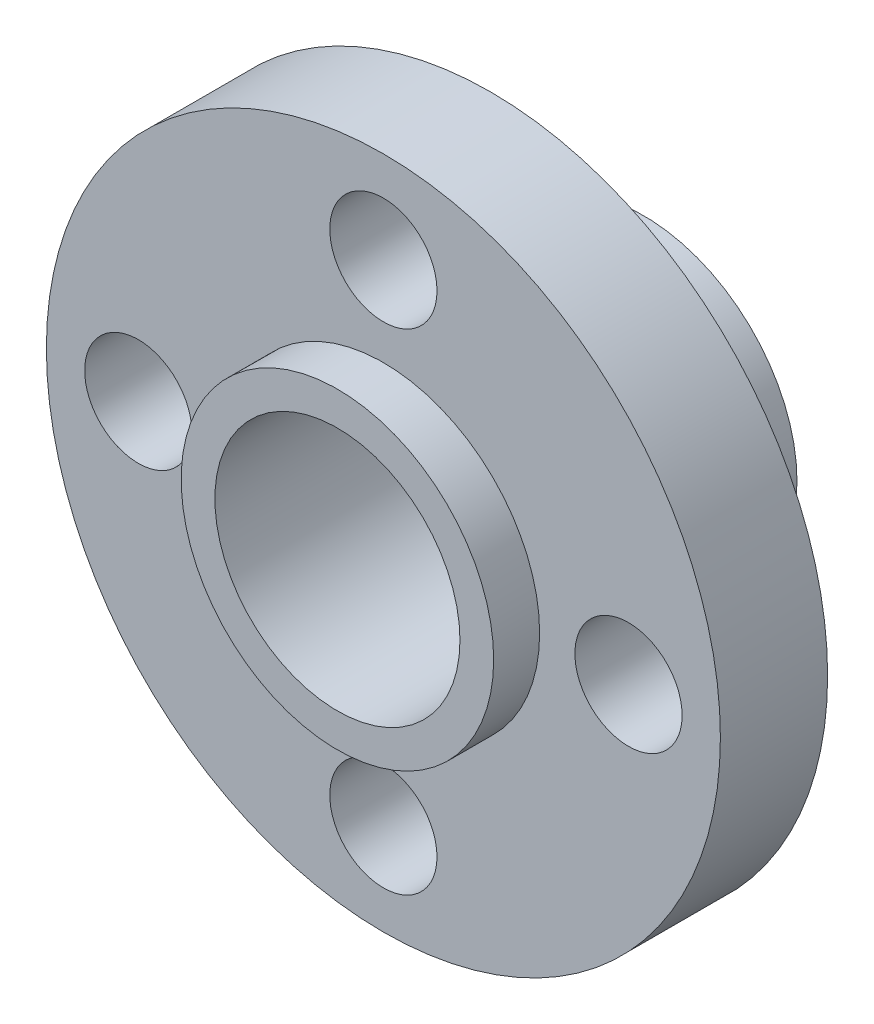
ISO-10303-21;
HEADER;
FILE_DESCRIPTION(('STEP AP214'),'2;1');
FILE_NAME('part.step','',(''),(''),'','','');
FILE_SCHEMA(('AUTOMOTIVE_DESIGN { 1 0 10303 214 1 1 1 1 }'));
ENDSEC;
DATA;
#1=APPLICATION_CONTEXT('core data for automotive mechanical design processes');
#2=APPLICATION_PROTOCOL_DEFINITION('international standard','automotive_design',2000,#1);
#3=PRODUCT_CONTEXT('',#1,'mechanical');
#4=PRODUCT('Part','Part','',(#3));
#5=PRODUCT_RELATED_PRODUCT_CATEGORY('part','',(#4));
#6=PRODUCT_DEFINITION_FORMATION('','',#4);
#7=PRODUCT_DEFINITION_CONTEXT('part definition',#1,'design');
#8=PRODUCT_DEFINITION('design','',#6,#7);
#9=PRODUCT_DEFINITION_SHAPE('','',#8);
#10=(LENGTH_UNIT() NAMED_UNIT(*) SI_UNIT(.MILLI.,.METRE.));
#11=(NAMED_UNIT(*) PLANE_ANGLE_UNIT() SI_UNIT($,.RADIAN.));
#12=(NAMED_UNIT(*) SI_UNIT($,.STERADIAN.) SOLID_ANGLE_UNIT());
#13=UNCERTAINTY_MEASURE_WITH_UNIT(LENGTH_MEASURE(1.E-05),#10,'distance_accuracy_value','');
#14=(GEOMETRIC_REPRESENTATION_CONTEXT(3) GLOBAL_UNCERTAINTY_ASSIGNED_CONTEXT((#13)) GLOBAL_UNIT_ASSIGNED_CONTEXT((#10,
#11,#12)) REPRESENTATION_CONTEXT('',''));
#15=CARTESIAN_POINT('',(0.,0.,0.));
#16=DIRECTION('',(0.,0.,1.));
#17=DIRECTION('',(1.,0.,0.));
#18=AXIS2_PLACEMENT_3D('',#15,#16,#17);
#19=CARTESIAN_POINT('',(0.,0.,3.5));
#20=DIRECTION('',(0.,0.,1.));
#21=DIRECTION('',(1.,0.,0.));
#22=AXIS2_PLACEMENT_3D('',#19,#20,#21);
#23=PLANE('',#22);
#24=CARTESIAN_POINT('',(0.,0.,3.5));
#25=DIRECTION('',(0.,0.,1.));
#26=DIRECTION('',(1.,0.,0.));
#27=AXIS2_PLACEMENT_3D('',#24,#25,#26);
#28=CIRCLE('',#27,5.1);
#29=CARTESIAN_POINT('',(5.1,0.,3.5));
#30=VERTEX_POINT('',#29);
#31=EDGE_CURVE('E73',#30,#30,#28,.T.);
#32=ORIENTED_EDGE('',*,*,#31,.F.);
#33=EDGE_LOOP('',(#32));
#34=FACE_BOUND('',#33,.T.);
#35=CARTESIAN_POINT('',(4.53155310047573E-13,-8.,3.5));
#36=DIRECTION('',(0.,0.,1.));
#37=DIRECTION('',(1.,0.,0.));
#38=AXIS2_PLACEMENT_3D('',#35,#36,#37);
#39=CIRCLE('',#38,1.75000000000049);
#40=CARTESIAN_POINT('',(1.75000000000094,-8.,3.5));
#41=VERTEX_POINT('',#40);
#42=EDGE_CURVE('E58',#41,#41,#39,.T.);
#43=ORIENTED_EDGE('',*,*,#42,.F.);
#44=EDGE_LOOP('',(#43));
#45=FACE_BOUND('',#44,.T.);
#46=CARTESIAN_POINT('',(0.,8.,3.5));
#47=DIRECTION('',(0.,0.,1.));
#48=DIRECTION('',(1.,0.,0.));
#49=AXIS2_PLACEMENT_3D('',#46,#47,#48);
#50=CIRCLE('',#49,1.75);
#51=CARTESIAN_POINT('',(1.75,8.,3.5));
#52=VERTEX_POINT('',#51);
#53=EDGE_CURVE('E47',#52,#52,#50,.T.);
#54=ORIENTED_EDGE('',*,*,#53,.F.);
#55=EDGE_LOOP('',(#54));
#56=FACE_BOUND('',#55,.T.);
#57=CARTESIAN_POINT('',(0.,0.,3.5));
#58=DIRECTION('',(0.,0.,1.));
#59=DIRECTION('',(1.,0.,0.));
#60=AXIS2_PLACEMENT_3D('',#57,#58,#59);
#61=CIRCLE('',#60,11.);
#62=CARTESIAN_POINT('',(11.,0.,3.5));
#63=VERTEX_POINT('',#62);
#64=EDGE_CURVE('E38',#63,#63,#61,.T.);
#65=ORIENTED_EDGE('',*,*,#64,.T.);
#66=EDGE_LOOP('',(#65));
#67=FACE_BOUND('',#66,.T.);
#68=CARTESIAN_POINT('',(8.00000000000023,2.26393958003914E-13,3.5));
#69=DIRECTION('',(0.,0.,1.));
#70=DIRECTION('',(1.,0.,0.));
#71=AXIS2_PLACEMENT_3D('',#68,#69,#70);
#72=CIRCLE('',#71,1.75000000000018);
#73=CARTESIAN_POINT('',(9.75000000000041,2.26393958003914E-13,3.5));
#74=VERTEX_POINT('',#73);
#75=EDGE_CURVE('E52',#74,#74,#72,.T.);
#76=ORIENTED_EDGE('',*,*,#75,.F.);
#77=EDGE_LOOP('',(#76));
#78=FACE_BOUND('',#77,.T.);
#79=CARTESIAN_POINT('',(-7.99999999999977,-2.27373675443232E-13,3.5));
#80=DIRECTION('',(0.,0.,1.));
#81=DIRECTION('',(1.,0.,0.));
#82=AXIS2_PLACEMENT_3D('',#79,#80,#81);
#83=CIRCLE('',#82,1.75000000000037);
#84=CARTESIAN_POINT('',(-6.24999999999941,-2.27373675443232E-13,3.5));
#85=VERTEX_POINT('',#84);
#86=EDGE_CURVE('E64',#85,#85,#83,.T.);
#87=ORIENTED_EDGE('',*,*,#86,.F.);
#88=EDGE_LOOP('',(#87));
#89=FACE_BOUND('',#88,.T.);
#90=ADVANCED_FACE('F31',(#34,#45,#56,#67,#78,#89),#23,.T.);
#91=CARTESIAN_POINT('',(0.,0.,0.));
#92=DIRECTION('',(0.,0.,1.));
#93=DIRECTION('',(1.,0.,0.));
#94=AXIS2_PLACEMENT_3D('',#91,#92,#93);
#95=PLANE('',#94);
#96=CARTESIAN_POINT('',(0.,0.,0.));
#97=DIRECTION('',(0.,0.,1.));
#98=DIRECTION('',(1.,0.,0.));
#99=AXIS2_PLACEMENT_3D('',#96,#97,#98);
#100=CIRCLE('',#99,5.);
#101=CARTESIAN_POINT('',(5.,0.,0.));
#102=VERTEX_POINT('',#101);
#103=EDGE_CURVE('E10',#102,#102,#100,.F.);
#104=ORIENTED_EDGE('',*,*,#103,.F.);
#105=EDGE_LOOP('',(#104));
#106=FACE_BOUND('',#105,.T.);
#107=CARTESIAN_POINT('',(0.,0.,0.));
#108=DIRECTION('',(0.,0.,1.));
#109=DIRECTION('',(1.,0.,0.));
#110=AXIS2_PLACEMENT_3D('',#107,#108,#109);
#111=CIRCLE('',#110,11.);
#112=CARTESIAN_POINT('',(11.,0.,0.));
#113=VERTEX_POINT('',#112);
#114=EDGE_CURVE('E42',#113,#113,#111,.T.);
#115=ORIENTED_EDGE('',*,*,#114,.F.);
#116=EDGE_LOOP('',(#115));
#117=FACE_BOUND('',#116,.T.);
#118=CARTESIAN_POINT('',(0.,8.,0.));
#119=DIRECTION('',(0.,0.,1.));
#120=DIRECTION('',(1.,0.,0.));
#121=AXIS2_PLACEMENT_3D('',#118,#119,#120);
#122=CIRCLE('',#121,1.75);
#123=CARTESIAN_POINT('',(1.75,8.,0.));
#124=VERTEX_POINT('',#123);
#125=EDGE_CURVE('E49',#124,#124,#122,.T.);
#126=ORIENTED_EDGE('',*,*,#125,.T.);
#127=EDGE_LOOP('',(#126));
#128=FACE_BOUND('',#127,.T.);
#129=CARTESIAN_POINT('',(8.00000000000023,2.26393958003914E-13,0.));
#130=DIRECTION('',(0.,0.,1.));
#131=DIRECTION('',(1.,0.,0.));
#132=AXIS2_PLACEMENT_3D('',#129,#130,#131);
#133=CIRCLE('',#132,1.75000000000018);
#134=CARTESIAN_POINT('',(9.75000000000041,2.26393958003914E-13,0.));
#135=VERTEX_POINT('',#134);
#136=EDGE_CURVE('E55',#135,#135,#133,.T.);
#137=ORIENTED_EDGE('',*,*,#136,.T.);
#138=EDGE_LOOP('',(#137));
#139=FACE_BOUND('',#138,.T.);
#140=CARTESIAN_POINT('',(4.53155310047573E-13,-8.,0.));
#141=DIRECTION('',(0.,0.,1.));
#142=DIRECTION('',(1.,0.,0.));
#143=AXIS2_PLACEMENT_3D('',#140,#141,#142);
#144=CIRCLE('',#143,1.75000000000049);
#145=CARTESIAN_POINT('',(1.75000000000094,-8.,0.));
#146=VERTEX_POINT('',#145);
#147=EDGE_CURVE('E61',#146,#146,#144,.T.);
#148=ORIENTED_EDGE('',*,*,#147,.T.);
#149=EDGE_LOOP('',(#148));
#150=FACE_BOUND('',#149,.T.);
#151=CARTESIAN_POINT('',(-7.99999999999977,-2.27373675443232E-13,0.));
#152=DIRECTION('',(0.,0.,1.));
#153=DIRECTION('',(1.,0.,0.));
#154=AXIS2_PLACEMENT_3D('',#151,#152,#153);
#155=CIRCLE('',#154,1.75000000000037);
#156=CARTESIAN_POINT('',(-6.24999999999941,-2.27373675443232E-13,0.));
#157=VERTEX_POINT('',#156);
#158=EDGE_CURVE('E67',#157,#157,#155,.T.);
#159=ORIENTED_EDGE('',*,*,#158,.T.);
#160=EDGE_LOOP('',(#159));
#161=FACE_BOUND('',#160,.T.);
#162=ADVANCED_FACE('F113',(#106,#117,#128,#139,#150,#161),#95,.F.);
#163=CARTESIAN_POINT('',(0.,0.,3.5));
#164=DIRECTION('',(0.,0.,-1.));
#165=DIRECTION('',(-1.,0.,0.));
#166=AXIS2_PLACEMENT_3D('',#163,#164,#165);
#167=CYLINDRICAL_SURFACE('',#166,11.);
#168=ORIENTED_EDGE('',*,*,#64,.F.);
#169=EDGE_LOOP('',(#168));
#170=FACE_BOUND('',#169,.T.);
#171=ORIENTED_EDGE('',*,*,#114,.T.);
#172=EDGE_LOOP('',(#171));
#173=FACE_BOUND('',#172,.T.);
#174=ADVANCED_FACE('F33',(#170,#173),#167,.T.);
#175=CARTESIAN_POINT('',(0.,8.,3.5));
#176=DIRECTION('',(0.,0.,-1.));
#177=DIRECTION('',(-1.,0.,0.));
#178=AXIS2_PLACEMENT_3D('',#175,#176,#177);
#179=CYLINDRICAL_SURFACE('',#178,1.75);
#180=ORIENTED_EDGE('',*,*,#53,.T.);
#181=EDGE_LOOP('',(#180));
#182=FACE_BOUND('',#181,.T.);
#183=ORIENTED_EDGE('',*,*,#125,.F.);
#184=EDGE_LOOP('',(#183));
#185=FACE_BOUND('',#184,.T.);
#186=ADVANCED_FACE('F134',(#182,#185),#179,.F.);
#187=CARTESIAN_POINT('',(8.00000000000023,2.26393958003914E-13,3.5));
#188=DIRECTION('',(0.,0.,-1.));
#189=DIRECTION('',(-1.,0.,0.));
#190=AXIS2_PLACEMENT_3D('',#187,#188,#189);
#191=CYLINDRICAL_SURFACE('',#190,1.75000000000018);
#192=ORIENTED_EDGE('',*,*,#75,.T.);
#193=EDGE_LOOP('',(#192));
#194=FACE_BOUND('',#193,.T.);
#195=ORIENTED_EDGE('',*,*,#136,.F.);
#196=EDGE_LOOP('',(#195));
#197=FACE_BOUND('',#196,.T.);
#198=ADVANCED_FACE('F140',(#194,#197),#191,.F.);
#199=CARTESIAN_POINT('',(4.53155310047573E-13,-8.,3.5));
#200=DIRECTION('',(0.,0.,-1.));
#201=DIRECTION('',(-1.,0.,0.));
#202=AXIS2_PLACEMENT_3D('',#199,#200,#201);
#203=CYLINDRICAL_SURFACE('',#202,1.75000000000049);
#204=ORIENTED_EDGE('',*,*,#42,.T.);
#205=EDGE_LOOP('',(#204));
#206=FACE_BOUND('',#205,.T.);
#207=ORIENTED_EDGE('',*,*,#147,.F.);
#208=EDGE_LOOP('',(#207));
#209=FACE_BOUND('',#208,.T.);
#210=ADVANCED_FACE('F125',(#206,#209),#203,.F.);
#211=CARTESIAN_POINT('',(-7.99999999999977,-2.27373675443232E-13,3.5));
#212=DIRECTION('',(0.,0.,-1.));
#213=DIRECTION('',(-1.,0.,0.));
#214=AXIS2_PLACEMENT_3D('',#211,#212,#213);
#215=CYLINDRICAL_SURFACE('',#214,1.75000000000037);
#216=ORIENTED_EDGE('',*,*,#86,.T.);
#217=EDGE_LOOP('',(#216));
#218=FACE_BOUND('',#217,.T.);
#219=ORIENTED_EDGE('',*,*,#158,.F.);
#220=EDGE_LOOP('',(#219));
#221=FACE_BOUND('',#220,.T.);
#222=ADVANCED_FACE('F107',(#218,#221),#215,.F.);
#223=CARTESIAN_POINT('',(0.,0.,5.));
#224=DIRECTION('',(0.,0.,-1.));
#225=DIRECTION('',(-1.,0.,0.));
#226=AXIS2_PLACEMENT_3D('',#223,#224,#225);
#227=CYLINDRICAL_SURFACE('',#226,5.1);
#228=CARTESIAN_POINT('',(0.,0.,5.));
#229=DIRECTION('',(0.,0.,1.));
#230=DIRECTION('',(1.,0.,0.));
#231=AXIS2_PLACEMENT_3D('',#228,#229,#230);
#232=CIRCLE('',#231,5.1);
#233=CARTESIAN_POINT('',(5.1,0.,5.));
#234=VERTEX_POINT('',#233);
#235=EDGE_CURVE('E70',#234,#234,#232,.T.);
#236=ORIENTED_EDGE('',*,*,#235,.F.);
#237=EDGE_LOOP('',(#236));
#238=FACE_BOUND('',#237,.T.);
#239=ORIENTED_EDGE('',*,*,#31,.T.);
#240=EDGE_LOOP('',(#239));
#241=FACE_BOUND('',#240,.T.);
#242=ADVANCED_FACE('F101',(#238,#241),#227,.T.);
#243=CARTESIAN_POINT('',(0.,0.,5.));
#244=DIRECTION('',(0.,0.,1.));
#245=DIRECTION('',(1.,0.,0.));
#246=AXIS2_PLACEMENT_3D('',#243,#244,#245);
#247=PLANE('',#246);
#248=CARTESIAN_POINT('',(0.,0.,5.));
#249=DIRECTION('',(0.,0.,1.));
#250=DIRECTION('',(1.,0.,0.));
#251=AXIS2_PLACEMENT_3D('',#248,#249,#250);
#252=CIRCLE('',#251,4.);
#253=CARTESIAN_POINT('',(4.,0.,5.));
#254=VERTEX_POINT('',#253);
#255=EDGE_CURVE('E82',#254,#254,#252,.T.);
#256=ORIENTED_EDGE('',*,*,#255,.F.);
#257=EDGE_LOOP('',(#256));
#258=FACE_BOUND('',#257,.T.);
#259=ORIENTED_EDGE('',*,*,#235,.T.);
#260=EDGE_LOOP('',(#259));
#261=FACE_BOUND('',#260,.T.);
#262=ADVANCED_FACE('F97',(#258,#261),#247,.T.);
#263=CARTESIAN_POINT('',(0.,0.,-5.));
#264=DIRECTION('',(0.,0.,1.));
#265=DIRECTION('',(1.,0.,0.));
#266=AXIS2_PLACEMENT_3D('',#263,#264,#265);
#267=CYLINDRICAL_SURFACE('',#266,5.);
#268=CARTESIAN_POINT('',(0.,0.,-5.));
#269=DIRECTION('',(0.,0.,-1.));
#270=DIRECTION('',(-1.,0.,0.));
#271=AXIS2_PLACEMENT_3D('',#268,#269,#270);
#272=CIRCLE('',#271,5.);
#273=CARTESIAN_POINT('',(-5.,0.,-5.));
#274=VERTEX_POINT('',#273);
#275=EDGE_CURVE('E76',#274,#274,#272,.T.);
#276=ORIENTED_EDGE('',*,*,#275,.F.);
#277=EDGE_LOOP('',(#276));
#278=FACE_BOUND('',#277,.T.);
#279=ORIENTED_EDGE('',*,*,#103,.T.);
#280=EDGE_LOOP('',(#279));
#281=FACE_BOUND('',#280,.T.);
#282=ADVANCED_FACE('F100',(#278,#281),#267,.T.);
#283=CARTESIAN_POINT('',(0.,0.,-5.));
#284=DIRECTION('',(0.,0.,-1.));
#285=DIRECTION('',(-1.,0.,0.));
#286=AXIS2_PLACEMENT_3D('',#283,#284,#285);
#287=PLANE('',#286);
#288=CARTESIAN_POINT('',(0.,0.,-5.));
#289=DIRECTION('',(0.,0.,1.));
#290=DIRECTION('',(1.,0.,0.));
#291=AXIS2_PLACEMENT_3D('',#288,#289,#290);
#292=CIRCLE('',#291,4.);
#293=CARTESIAN_POINT('',(4.,0.,-5.));
#294=VERTEX_POINT('',#293);
#295=EDGE_CURVE('E81',#294,#294,#292,.T.);
#296=ORIENTED_EDGE('',*,*,#295,.T.);
#297=EDGE_LOOP('',(#296));
#298=FACE_BOUND('',#297,.T.);
#299=ORIENTED_EDGE('',*,*,#275,.T.);
#300=EDGE_LOOP('',(#299));
#301=FACE_BOUND('',#300,.T.);
#302=ADVANCED_FACE('F88',(#298,#301),#287,.T.);
#303=CARTESIAN_POINT('',(0.,0.,-5.));
#304=DIRECTION('',(0.,0.,1.));
#305=DIRECTION('',(1.,0.,0.));
#306=AXIS2_PLACEMENT_3D('',#303,#304,#305);
#307=CYLINDRICAL_SURFACE('',#306,4.);
#308=ORIENTED_EDGE('',*,*,#295,.F.);
#309=EDGE_LOOP('',(#308));
#310=FACE_BOUND('',#309,.T.);
#311=ORIENTED_EDGE('',*,*,#255,.T.);
#312=EDGE_LOOP('',(#311));
#313=FACE_BOUND('',#312,.T.);
#314=ADVANCED_FACE('F91',(#310,#313),#307,.F.);
#315=CLOSED_SHELL('',(#90,#162,#174,#186,#198,#210,#222,#242,#262,#282,#302,#314));
#316=MANIFOLD_SOLID_BREP('B2',#315);
#317=ADVANCED_BREP_SHAPE_REPRESENTATION('',(#18,#316),#14);
#318=SHAPE_DEFINITION_REPRESENTATION(#9,#317);
ENDSEC;
END-ISO-10303-21;
